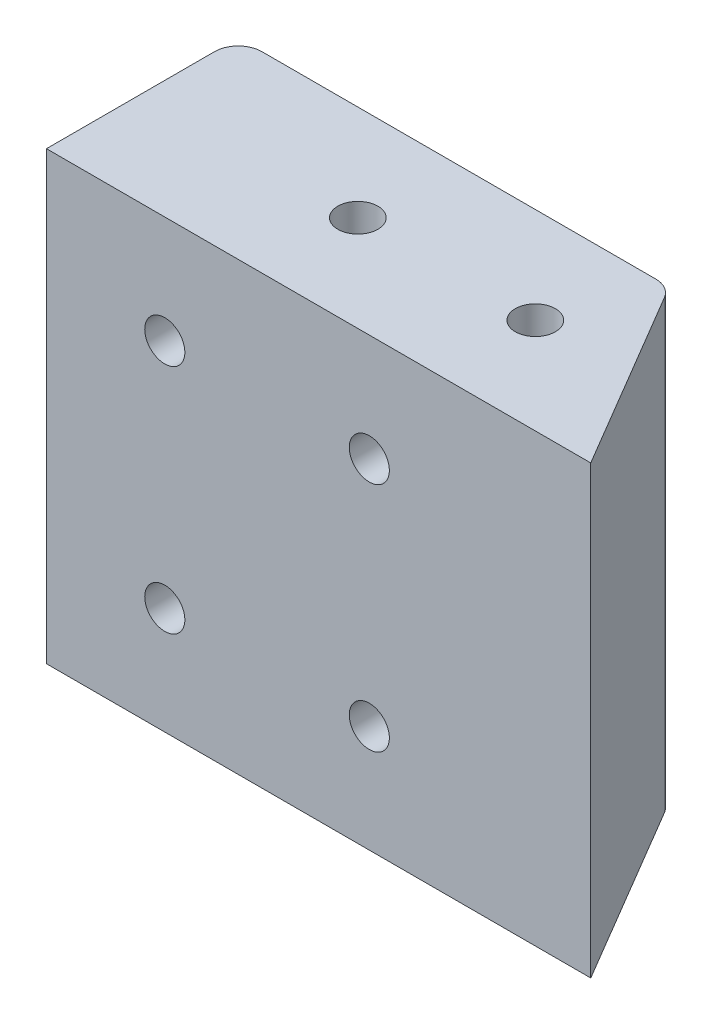
ISO-10303-21;
HEADER;
FILE_DESCRIPTION(('STEP AP214'),'2;1');
FILE_NAME('part.step','',(''),(''),'','','');
FILE_SCHEMA(('AUTOMOTIVE_DESIGN { 1 0 10303 214 1 1 1 1 }'));
ENDSEC;
DATA;
#1=APPLICATION_CONTEXT('core data for automotive mechanical design processes');
#2=APPLICATION_PROTOCOL_DEFINITION('international standard','automotive_design',2000,#1);
#3=PRODUCT_CONTEXT('',#1,'mechanical');
#4=PRODUCT('Part','Part','',(#3));
#5=PRODUCT_RELATED_PRODUCT_CATEGORY('part','',(#4));
#6=PRODUCT_DEFINITION_FORMATION('','',#4);
#7=PRODUCT_DEFINITION_CONTEXT('part definition',#1,'design');
#8=PRODUCT_DEFINITION('design','',#6,#7);
#9=PRODUCT_DEFINITION_SHAPE('','',#8);
#10=(LENGTH_UNIT() NAMED_UNIT(*) SI_UNIT(.MILLI.,.METRE.));
#11=(NAMED_UNIT(*) PLANE_ANGLE_UNIT() SI_UNIT($,.RADIAN.));
#12=(NAMED_UNIT(*) SI_UNIT($,.STERADIAN.) SOLID_ANGLE_UNIT());
#13=UNCERTAINTY_MEASURE_WITH_UNIT(LENGTH_MEASURE(1.E-05),#10,'distance_accuracy_value','');
#14=(GEOMETRIC_REPRESENTATION_CONTEXT(3) GLOBAL_UNCERTAINTY_ASSIGNED_CONTEXT((#13)) GLOBAL_UNIT_ASSIGNED_CONTEXT((#10,
#11,#12)) REPRESENTATION_CONTEXT('',''));
#15=CARTESIAN_POINT('',(0.,0.,0.));
#16=DIRECTION('',(0.,0.,1.));
#17=DIRECTION('',(1.,0.,0.));
#18=AXIS2_PLACEMENT_3D('',#15,#16,#17);
#19=CARTESIAN_POINT('',(78.2126412853854,152.4635,-54.5560549528601));
#20=DIRECTION('',(0.,-1.,0.));
#21=DIRECTION('',(0.,0.,-1.));
#22=AXIS2_PLACEMENT_3D('',#19,#20,#21);
#23=PLANE('',#22);
#24=CARTESIAN_POINT('',(56.5316517718266,152.4635,-46.8042774764301));
#25=DIRECTION('',(0.,-1.,0.));
#26=DIRECTION('',(0.,0.,-1.));
#27=AXIS2_PLACEMENT_3D('',#24,#25,#26);
#28=CIRCLE('',#27,2.15265);
#29=CARTESIAN_POINT('',(56.5316517718266,152.4635,-48.9569274764301));
#30=VERTEX_POINT('',#29);
#31=EDGE_CURVE('E129',#30,#30,#28,.T.);
#32=ORIENTED_EDGE('',*,*,#31,.F.);
#33=EDGE_LOOP('',(#32));
#34=FACE_BOUND('',#33,.T.);
#35=DIRECTION('',(-1.,0.,0.));
#36=VECTOR('',#35,1.);
#37=CARTESIAN_POINT('',(33.4010000000002,152.4635,-36.5125));
#38=LINE('',#37,#36);
#39=CARTESIAN_POINT('',(91.8210000000002,152.4635,-36.5125));
#40=VERTEX_POINT('',#39);
#41=CARTESIAN_POINT('',(33.4010000000002,152.4635,-36.5125));
#42=VERTEX_POINT('',#41);
#43=EDGE_CURVE('E136',#40,#42,#38,.T.);
#44=ORIENTED_EDGE('',*,*,#43,.T.);
#45=DIRECTION('',(0.,0.,-1.));
#46=VECTOR('',#45,1.);
#47=CARTESIAN_POINT('',(33.4010000000002,152.4635,-54.5560549528601));
#48=LINE('',#47,#46);
#49=CARTESIAN_POINT('',(33.4010000000002,152.4635,-54.5560549528601));
#50=VERTEX_POINT('',#49);
#51=EDGE_CURVE('E94',#42,#50,#48,.T.);
#52=ORIENTED_EDGE('',*,*,#51,.T.);
#53=CARTESIAN_POINT('',(35.9410000000002,152.4635,-54.5560549528601));
#54=DIRECTION('',(0.,-1.,0.));
#55=DIRECTION('',(0.,0.,1.));
#56=AXIS2_PLACEMENT_3D('',#53,#54,#55);
#57=CIRCLE('',#56,2.54);
#58=CARTESIAN_POINT('',(35.9410000000002,152.4635,-57.0960549528601));
#59=VERTEX_POINT('',#58);
#60=EDGE_CURVE('E107',#50,#59,#57,.T.);
#61=ORIENTED_EDGE('',*,*,#60,.T.);
#62=DIRECTION('',(1.,0.,0.));
#63=VECTOR('',#62,1.);
#64=CARTESIAN_POINT('',(35.9410000000002,152.4635,-57.0960549528601));
#65=LINE('',#64,#63);
#66=CARTESIAN_POINT('',(78.2126412853854,152.4635,-57.0960549528601));
#67=VERTEX_POINT('',#66);
#68=EDGE_CURVE('E101',#59,#67,#65,.T.);
#69=ORIENTED_EDGE('',*,*,#68,.T.);
#70=CARTESIAN_POINT('',(78.2126412853854,152.4635,-54.5560549528601));
#71=DIRECTION('',(0.,-1.,0.));
#72=DIRECTION('',(0.,0.,-1.));
#73=AXIS2_PLACEMENT_3D('',#70,#71,#72);
#74=CIRCLE('',#73,2.54);
#75=CARTESIAN_POINT('',(80.3995953560437,152.4635,-55.8478877179002));
#76=VERTEX_POINT('',#75);
#77=EDGE_CURVE('E105',#67,#76,#74,.T.);
#78=ORIENTED_EDGE('',*,*,#77,.T.);
#79=DIRECTION('',(0.508595576787421,0.,0.861005539629258));
#80=VECTOR('',#79,1.);
#81=CARTESIAN_POINT('',(91.8210000000002,152.4635,-36.5125));
#82=LINE('',#81,#80);
#83=EDGE_CURVE('E57',#76,#40,#82,.T.);
#84=ORIENTED_EDGE('',*,*,#83,.T.);
#85=EDGE_LOOP('',(#44,#52,#61,#69,#78,#84));
#86=FACE_BOUND('',#85,.T.);
#87=CARTESIAN_POINT('',(75.5816517718266,152.4635,-46.8042774764301));
#88=DIRECTION('',(0.,-1.,0.));
#89=DIRECTION('',(0.,0.,-1.));
#90=AXIS2_PLACEMENT_3D('',#87,#88,#89);
#91=CIRCLE('',#90,2.15265000000001);
#92=CARTESIAN_POINT('',(75.5816517718266,152.4635,-48.9569274764301));
#93=VERTEX_POINT('',#92);
#94=EDGE_CURVE('E203',#93,#93,#91,.T.);
#95=ORIENTED_EDGE('',*,*,#94,.F.);
#96=EDGE_LOOP('',(#95));
#97=FACE_BOUND('',#96,.T.);
#98=ADVANCED_FACE('F40',(#34,#86,#97),#23,.T.);
#99=CARTESIAN_POINT('',(78.2126412853854,200.3425,-54.5560549528601));
#100=DIRECTION('',(0.,-1.,0.));
#101=DIRECTION('',(0.,0.,-1.));
#102=AXIS2_PLACEMENT_3D('',#99,#100,#101);
#103=PLANE('',#102);
#104=DIRECTION('',(-1.,0.,0.));
#105=VECTOR('',#104,1.);
#106=CARTESIAN_POINT('',(33.4010000000002,200.3425,-36.5125));
#107=LINE('',#106,#105);
#108=CARTESIAN_POINT('',(91.8210000000002,200.3425,-36.5125));
#109=VERTEX_POINT('',#108);
#110=CARTESIAN_POINT('',(33.4010000000002,200.3425,-36.5125));
#111=VERTEX_POINT('',#110);
#112=EDGE_CURVE('E125',#109,#111,#107,.T.);
#113=ORIENTED_EDGE('',*,*,#112,.F.);
#114=DIRECTION('',(0.508595576787421,0.,0.861005539629258));
#115=VECTOR('',#114,1.);
#116=CARTESIAN_POINT('',(91.8210000000002,200.3425,-36.5125));
#117=LINE('',#116,#115);
#118=CARTESIAN_POINT('',(80.3995953560437,200.3425,-55.8478877179002));
#119=VERTEX_POINT('',#118);
#120=EDGE_CURVE('E86',#119,#109,#117,.T.);
#121=ORIENTED_EDGE('',*,*,#120,.F.);
#122=CARTESIAN_POINT('',(78.2126412853854,200.3425,-54.5560549528601));
#123=DIRECTION('',(0.,-1.,0.));
#124=DIRECTION('',(0.,0.,-1.));
#125=AXIS2_PLACEMENT_3D('',#122,#123,#124);
#126=CIRCLE('',#125,2.54);
#127=CARTESIAN_POINT('',(78.2126412853854,200.3425,-57.0960549528601));
#128=VERTEX_POINT('',#127);
#129=EDGE_CURVE('E80',#128,#119,#126,.T.);
#130=ORIENTED_EDGE('',*,*,#129,.F.);
#131=DIRECTION('',(1.,0.,0.));
#132=VECTOR('',#131,1.);
#133=CARTESIAN_POINT('',(35.9410000000002,200.3425,-57.0960549528601));
#134=LINE('',#133,#132);
#135=CARTESIAN_POINT('',(35.9410000000002,200.3425,-57.0960549528601));
#136=VERTEX_POINT('',#135);
#137=EDGE_CURVE('E115',#136,#128,#134,.T.);
#138=ORIENTED_EDGE('',*,*,#137,.F.);
#139=CARTESIAN_POINT('',(35.9410000000002,200.3425,-54.5560549528601));
#140=DIRECTION('',(0.,-1.,0.));
#141=DIRECTION('',(0.,0.,1.));
#142=AXIS2_PLACEMENT_3D('',#139,#140,#141);
#143=CIRCLE('',#142,2.54);
#144=CARTESIAN_POINT('',(33.4010000000002,200.3425,-54.5560549528601));
#145=VERTEX_POINT('',#144);
#146=EDGE_CURVE('E131',#145,#136,#143,.T.);
#147=ORIENTED_EDGE('',*,*,#146,.F.);
#148=DIRECTION('',(0.,0.,-1.));
#149=VECTOR('',#148,1.);
#150=CARTESIAN_POINT('',(33.4010000000002,200.3425,-54.5560549528601));
#151=LINE('',#150,#149);
#152=EDGE_CURVE('E128',#111,#145,#151,.T.);
#153=ORIENTED_EDGE('',*,*,#152,.F.);
#154=EDGE_LOOP('',(#113,#121,#130,#138,#147,#153));
#155=FACE_BOUND('',#154,.T.);
#156=CARTESIAN_POINT('',(56.5316517718266,200.3425,-46.8042774764301));
#157=DIRECTION('',(0.,-1.,0.));
#158=DIRECTION('',(0.,0.,-1.));
#159=AXIS2_PLACEMENT_3D('',#156,#157,#158);
#160=CIRCLE('',#159,2.15265);
#161=CARTESIAN_POINT('',(56.5316517718266,200.3425,-48.9569274764301));
#162=VERTEX_POINT('',#161);
#163=EDGE_CURVE('E211',#162,#162,#160,.T.);
#164=ORIENTED_EDGE('',*,*,#163,.T.);
#165=EDGE_LOOP('',(#164));
#166=FACE_BOUND('',#165,.T.);
#167=CARTESIAN_POINT('',(75.5816517718266,200.3425,-46.8042774764301));
#168=DIRECTION('',(0.,-1.,0.));
#169=DIRECTION('',(0.,0.,-1.));
#170=AXIS2_PLACEMENT_3D('',#167,#168,#169);
#171=CIRCLE('',#170,2.15265000000001);
#172=CARTESIAN_POINT('',(75.5816517718266,200.3425,-48.9569274764301));
#173=VERTEX_POINT('',#172);
#174=EDGE_CURVE('E199',#173,#173,#171,.T.);
#175=ORIENTED_EDGE('',*,*,#174,.T.);
#176=EDGE_LOOP('',(#175));
#177=FACE_BOUND('',#176,.T.);
#178=ADVANCED_FACE('F145',(#155,#166,#177),#103,.F.);
#179=CARTESIAN_POINT('',(33.4010000000002,152.4635,-36.5125));
#180=DIRECTION('',(0.,0.,-1.));
#181=DIRECTION('',(-1.,0.,0.));
#182=AXIS2_PLACEMENT_3D('',#179,#180,#181);
#183=PLANE('',#182);
#184=CARTESIAN_POINT('',(68.0526412853853,188.834769871523,-36.5125));
#185=DIRECTION('',(0.,0.,-1.));
#186=DIRECTION('',(-1.,0.,0.));
#187=AXIS2_PLACEMENT_3D('',#184,#185,#186);
#188=CIRCLE('',#187,2.15265000000001);
#189=CARTESIAN_POINT('',(65.8999912853853,188.834769871523,-36.5125));
#190=VERTEX_POINT('',#189);
#191=EDGE_CURVE('E197',#190,#190,#188,.T.);
#192=ORIENTED_EDGE('',*,*,#191,.T.);
#193=EDGE_LOOP('',(#192));
#194=FACE_BOUND('',#193,.T.);
#195=CARTESIAN_POINT('',(68.0526412853853,163.971230128477,-36.5125));
#196=DIRECTION('',(0.,0.,-1.));
#197=DIRECTION('',(-1.,0.,0.));
#198=AXIS2_PLACEMENT_3D('',#195,#196,#197);
#199=CIRCLE('',#198,2.15265000000001);
#200=CARTESIAN_POINT('',(65.8999912853853,163.971230128477,-36.5125));
#201=VERTEX_POINT('',#200);
#202=EDGE_CURVE('E200',#201,#201,#199,.T.);
#203=ORIENTED_EDGE('',*,*,#202,.T.);
#204=EDGE_LOOP('',(#203));
#205=FACE_BOUND('',#204,.T.);
#206=CARTESIAN_POINT('',(46.1010000000002,163.971230128477,-36.5125));
#207=DIRECTION('',(0.,0.,-1.));
#208=DIRECTION('',(-1.,0.,0.));
#209=AXIS2_PLACEMENT_3D('',#206,#207,#208);
#210=CIRCLE('',#209,2.15265);
#211=CARTESIAN_POINT('',(43.9483500000002,163.971230128477,-36.5125));
#212=VERTEX_POINT('',#211);
#213=EDGE_CURVE('E206',#212,#212,#210,.T.);
#214=ORIENTED_EDGE('',*,*,#213,.T.);
#215=EDGE_LOOP('',(#214));
#216=FACE_BOUND('',#215,.T.);
#217=CARTESIAN_POINT('',(46.1010000000002,188.834769871523,-36.5125));
#218=DIRECTION('',(0.,0.,-1.));
#219=DIRECTION('',(-1.,0.,0.));
#220=AXIS2_PLACEMENT_3D('',#217,#218,#219);
#221=CIRCLE('',#220,2.15265);
#222=CARTESIAN_POINT('',(43.9483500000002,188.834769871523,-36.5125));
#223=VERTEX_POINT('',#222);
#224=EDGE_CURVE('E226',#223,#223,#221,.T.);
#225=ORIENTED_EDGE('',*,*,#224,.T.);
#226=EDGE_LOOP('',(#225));
#227=FACE_BOUND('',#226,.T.);
#228=ORIENTED_EDGE('',*,*,#112,.T.);
#229=DIRECTION('',(0.,1.,0.));
#230=VECTOR('',#229,1.);
#231=CARTESIAN_POINT('',(33.4010000000002,152.4635,-36.5125));
#232=LINE('',#231,#230);
#233=EDGE_CURVE('E11',#42,#111,#232,.T.);
#234=ORIENTED_EDGE('',*,*,#233,.F.);
#235=ORIENTED_EDGE('',*,*,#43,.F.);
#236=DIRECTION('',(0.,1.,0.));
#237=VECTOR('',#236,1.);
#238=CARTESIAN_POINT('',(91.8210000000002,152.4635,-36.5125));
#239=LINE('',#238,#237);
#240=EDGE_CURVE('E121',#40,#109,#239,.T.);
#241=ORIENTED_EDGE('',*,*,#240,.T.);
#242=EDGE_LOOP('',(#228,#234,#235,#241));
#243=FACE_BOUND('',#242,.T.);
#244=ADVANCED_FACE('F42',(#194,#205,#216,#227,#243),#183,.F.);
#245=CARTESIAN_POINT('',(33.4010000000002,152.4635,-54.5560549528601));
#246=DIRECTION('',(1.,0.,0.));
#247=DIRECTION('',(0.,0.,-1.));
#248=AXIS2_PLACEMENT_3D('',#245,#246,#247);
#249=PLANE('',#248);
#250=ORIENTED_EDGE('',*,*,#152,.T.);
#251=DIRECTION('',(0.,1.,0.));
#252=VECTOR('',#251,1.);
#253=CARTESIAN_POINT('',(33.4010000000002,152.4635,-54.5560549528601));
#254=LINE('',#253,#252);
#255=EDGE_CURVE('E49',#50,#145,#254,.T.);
#256=ORIENTED_EDGE('',*,*,#255,.F.);
#257=ORIENTED_EDGE('',*,*,#51,.F.);
#258=ORIENTED_EDGE('',*,*,#233,.T.);
#259=EDGE_LOOP('',(#250,#256,#257,#258));
#260=FACE_BOUND('',#259,.T.);
#261=ADVANCED_FACE('F252',(#260),#249,.F.);
#262=CARTESIAN_POINT('',(35.9410000000002,152.4635,-54.5560549528601));
#263=DIRECTION('',(0.,1.,0.));
#264=DIRECTION('',(0.,0.,1.));
#265=AXIS2_PLACEMENT_3D('',#262,#263,#264);
#266=CYLINDRICAL_SURFACE('',#265,2.54);
#267=ORIENTED_EDGE('',*,*,#146,.T.);
#268=DIRECTION('',(0.,1.,0.));
#269=VECTOR('',#268,1.);
#270=CARTESIAN_POINT('',(35.9410000000002,152.4635,-57.0960549528601));
#271=LINE('',#270,#269);
#272=EDGE_CURVE('E116',#59,#136,#271,.T.);
#273=ORIENTED_EDGE('',*,*,#272,.F.);
#274=ORIENTED_EDGE('',*,*,#60,.F.);
#275=ORIENTED_EDGE('',*,*,#255,.T.);
#276=EDGE_LOOP('',(#267,#273,#274,#275));
#277=FACE_BOUND('',#276,.T.);
#278=ADVANCED_FACE('F142',(#277),#266,.T.);
#279=CARTESIAN_POINT('',(35.9410000000002,152.4635,-57.0960549528601));
#280=DIRECTION('',(0.,0.,1.));
#281=DIRECTION('',(1.,0.,0.));
#282=AXIS2_PLACEMENT_3D('',#279,#280,#281);
#283=PLANE('',#282);
#284=CARTESIAN_POINT('',(68.0526412853854,188.834769871523,-57.0960549528601));
#285=DIRECTION('',(0.,0.,-1.));
#286=DIRECTION('',(-1.,0.,0.));
#287=AXIS2_PLACEMENT_3D('',#284,#285,#286);
#288=CIRCLE('',#287,2.15265000000001);
#289=CARTESIAN_POINT('',(65.8999912853854,188.834769871523,-57.0960549528601));
#290=VERTEX_POINT('',#289);
#291=EDGE_CURVE('E194',#290,#290,#288,.T.);
#292=ORIENTED_EDGE('',*,*,#291,.F.);
#293=EDGE_LOOP('',(#292));
#294=FACE_BOUND('',#293,.T.);
#295=CARTESIAN_POINT('',(68.0526412853854,163.971230128477,-57.0960549528601));
#296=DIRECTION('',(0.,0.,-1.));
#297=DIRECTION('',(-1.,0.,0.));
#298=AXIS2_PLACEMENT_3D('',#295,#296,#297);
#299=CIRCLE('',#298,2.15265000000001);
#300=CARTESIAN_POINT('',(65.8999912853854,163.971230128477,-57.0960549528601));
#301=VERTEX_POINT('',#300);
#302=EDGE_CURVE('E235',#301,#301,#299,.T.);
#303=ORIENTED_EDGE('',*,*,#302,.F.);
#304=EDGE_LOOP('',(#303));
#305=FACE_BOUND('',#304,.T.);
#306=CARTESIAN_POINT('',(46.1010000000002,163.971230128477,-57.0960549528601));
#307=DIRECTION('',(0.,0.,-1.));
#308=DIRECTION('',(-1.,0.,0.));
#309=AXIS2_PLACEMENT_3D('',#306,#307,#308);
#310=CIRCLE('',#309,2.15265);
#311=CARTESIAN_POINT('',(43.9483500000002,163.971230128477,-57.0960549528601));
#312=VERTEX_POINT('',#311);
#313=EDGE_CURVE('E232',#312,#312,#310,.T.);
#314=ORIENTED_EDGE('',*,*,#313,.F.);
#315=EDGE_LOOP('',(#314));
#316=FACE_BOUND('',#315,.T.);
#317=CARTESIAN_POINT('',(46.1010000000002,188.834769871523,-57.0960549528601));
#318=DIRECTION('',(0.,0.,-1.));
#319=DIRECTION('',(-1.,0.,0.));
#320=AXIS2_PLACEMENT_3D('',#317,#318,#319);
#321=CIRCLE('',#320,2.15265);
#322=CARTESIAN_POINT('',(43.9483500000002,188.834769871523,-57.0960549528601));
#323=VERTEX_POINT('',#322);
#324=EDGE_CURVE('E229',#323,#323,#321,.T.);
#325=ORIENTED_EDGE('',*,*,#324,.F.);
#326=EDGE_LOOP('',(#325));
#327=FACE_BOUND('',#326,.T.);
#328=ORIENTED_EDGE('',*,*,#137,.T.);
#329=DIRECTION('',(0.,1.,0.));
#330=VECTOR('',#329,1.);
#331=CARTESIAN_POINT('',(78.2126412853854,152.4635,-57.0960549528601));
#332=LINE('',#331,#330);
#333=EDGE_CURVE('E112',#67,#128,#332,.T.);
#334=ORIENTED_EDGE('',*,*,#333,.F.);
#335=ORIENTED_EDGE('',*,*,#68,.F.);
#336=ORIENTED_EDGE('',*,*,#272,.T.);
#337=EDGE_LOOP('',(#328,#334,#335,#336));
#338=FACE_BOUND('',#337,.T.);
#339=ADVANCED_FACE('F113',(#294,#305,#316,#327,#338),#283,.F.);
#340=CARTESIAN_POINT('',(78.2126412853854,152.4635,-54.5560549528601));
#341=DIRECTION('',(0.,1.,0.));
#342=DIRECTION('',(0.,0.,1.));
#343=AXIS2_PLACEMENT_3D('',#340,#341,#342);
#344=CYLINDRICAL_SURFACE('',#343,2.54);
#345=ORIENTED_EDGE('',*,*,#129,.T.);
#346=DIRECTION('',(0.,1.,0.));
#347=VECTOR('',#346,1.);
#348=CARTESIAN_POINT('',(80.3995953560437,152.4635,-55.8478877179002));
#349=LINE('',#348,#347);
#350=EDGE_CURVE('E117',#76,#119,#349,.T.);
#351=ORIENTED_EDGE('',*,*,#350,.F.);
#352=ORIENTED_EDGE('',*,*,#77,.F.);
#353=ORIENTED_EDGE('',*,*,#333,.T.);
#354=EDGE_LOOP('',(#345,#351,#352,#353));
#355=FACE_BOUND('',#354,.T.);
#356=ADVANCED_FACE('F119',(#355),#344,.T.);
#357=CARTESIAN_POINT('',(91.8210000000002,152.4635,-36.5125));
#358=DIRECTION('',(-0.861005539629258,0.,0.508595576787421));
#359=DIRECTION('',(0.508595576787421,0.,0.861005539629258));
#360=AXIS2_PLACEMENT_3D('',#357,#358,#359);
#361=PLANE('',#360);
#362=ORIENTED_EDGE('',*,*,#120,.T.);
#363=ORIENTED_EDGE('',*,*,#240,.F.);
#364=ORIENTED_EDGE('',*,*,#83,.F.);
#365=ORIENTED_EDGE('',*,*,#350,.T.);
#366=EDGE_LOOP('',(#362,#363,#364,#365));
#367=FACE_BOUND('',#366,.T.);
#368=ADVANCED_FACE('F150',(#367),#361,.F.);
#369=CARTESIAN_POINT('',(56.5316517718266,152.4635,-46.8042774764301));
#370=DIRECTION('',(0.,1.,0.));
#371=DIRECTION('',(0.,0.,1.));
#372=AXIS2_PLACEMENT_3D('',#369,#370,#371);
#373=CYLINDRICAL_SURFACE('',#372,2.15265);
#374=ORIENTED_EDGE('',*,*,#31,.T.);
#375=EDGE_LOOP('',(#374));
#376=FACE_BOUND('',#375,.T.);
#377=ORIENTED_EDGE('',*,*,#163,.F.);
#378=EDGE_LOOP('',(#377));
#379=FACE_BOUND('',#378,.T.);
#380=ADVANCED_FACE('F152',(#376,#379),#373,.F.);
#381=CARTESIAN_POINT('',(75.5816517718266,152.4635,-46.8042774764301));
#382=DIRECTION('',(0.,1.,0.));
#383=DIRECTION('',(0.,0.,1.));
#384=AXIS2_PLACEMENT_3D('',#381,#382,#383);
#385=CYLINDRICAL_SURFACE('',#384,2.15265000000001);
#386=ORIENTED_EDGE('',*,*,#94,.T.);
#387=EDGE_LOOP('',(#386));
#388=FACE_BOUND('',#387,.T.);
#389=ORIENTED_EDGE('',*,*,#174,.F.);
#390=EDGE_LOOP('',(#389));
#391=FACE_BOUND('',#390,.T.);
#392=ADVANCED_FACE('F158',(#388,#391),#385,.F.);
#393=CARTESIAN_POINT('',(46.1010000000002,188.834769871523,-24.0738863499151));
#394=DIRECTION('',(0.,0.,-1.));
#395=DIRECTION('',(-1.,0.,0.));
#396=AXIS2_PLACEMENT_3D('',#393,#394,#395);
#397=CYLINDRICAL_SURFACE('',#396,2.15265);
#398=ORIENTED_EDGE('',*,*,#324,.T.);
#399=EDGE_LOOP('',(#398));
#400=FACE_BOUND('',#399,.T.);
#401=ORIENTED_EDGE('',*,*,#224,.F.);
#402=EDGE_LOOP('',(#401));
#403=FACE_BOUND('',#402,.T.);
#404=ADVANCED_FACE('F173',(#400,#403),#397,.F.);
#405=CARTESIAN_POINT('',(46.1010000000002,163.971230128477,-24.0738863499151));
#406=DIRECTION('',(0.,0.,-1.));
#407=DIRECTION('',(-1.,0.,0.));
#408=AXIS2_PLACEMENT_3D('',#405,#406,#407);
#409=CYLINDRICAL_SURFACE('',#408,2.15265);
#410=ORIENTED_EDGE('',*,*,#313,.T.);
#411=EDGE_LOOP('',(#410));
#412=FACE_BOUND('',#411,.T.);
#413=ORIENTED_EDGE('',*,*,#213,.F.);
#414=EDGE_LOOP('',(#413));
#415=FACE_BOUND('',#414,.T.);
#416=ADVANCED_FACE('F177',(#412,#415),#409,.F.);
#417=CARTESIAN_POINT('',(68.0526412853853,163.971230128477,-24.0738863499151));
#418=DIRECTION('',(0.,0.,-1.));
#419=DIRECTION('',(-1.,0.,0.));
#420=AXIS2_PLACEMENT_3D('',#417,#418,#419);
#421=CYLINDRICAL_SURFACE('',#420,2.15265000000001);
#422=ORIENTED_EDGE('',*,*,#302,.T.);
#423=EDGE_LOOP('',(#422));
#424=FACE_BOUND('',#423,.T.);
#425=ORIENTED_EDGE('',*,*,#202,.F.);
#426=EDGE_LOOP('',(#425));
#427=FACE_BOUND('',#426,.T.);
#428=ADVANCED_FACE('F181',(#424,#427),#421,.F.);
#429=CARTESIAN_POINT('',(68.0526412853853,188.834769871523,-24.0738863499151));
#430=DIRECTION('',(0.,0.,-1.));
#431=DIRECTION('',(-1.,0.,0.));
#432=AXIS2_PLACEMENT_3D('',#429,#430,#431);
#433=CYLINDRICAL_SURFACE('',#432,2.15265000000001);
#434=ORIENTED_EDGE('',*,*,#291,.T.);
#435=EDGE_LOOP('',(#434));
#436=FACE_BOUND('',#435,.T.);
#437=ORIENTED_EDGE('',*,*,#191,.F.);
#438=EDGE_LOOP('',(#437));
#439=FACE_BOUND('',#438,.T.);
#440=ADVANCED_FACE('F185',(#436,#439),#433,.F.);
#441=CLOSED_SHELL('',(#98,#178,#244,#261,#278,#339,#356,#368,#380,#392,#404,#416,#428,#440));
#442=MANIFOLD_SOLID_BREP('B2',#441);
#443=ADVANCED_BREP_SHAPE_REPRESENTATION('',(#18,#442),#14);
#444=SHAPE_DEFINITION_REPRESENTATION(#9,#443);
ENDSEC;
END-ISO-10303-21;
